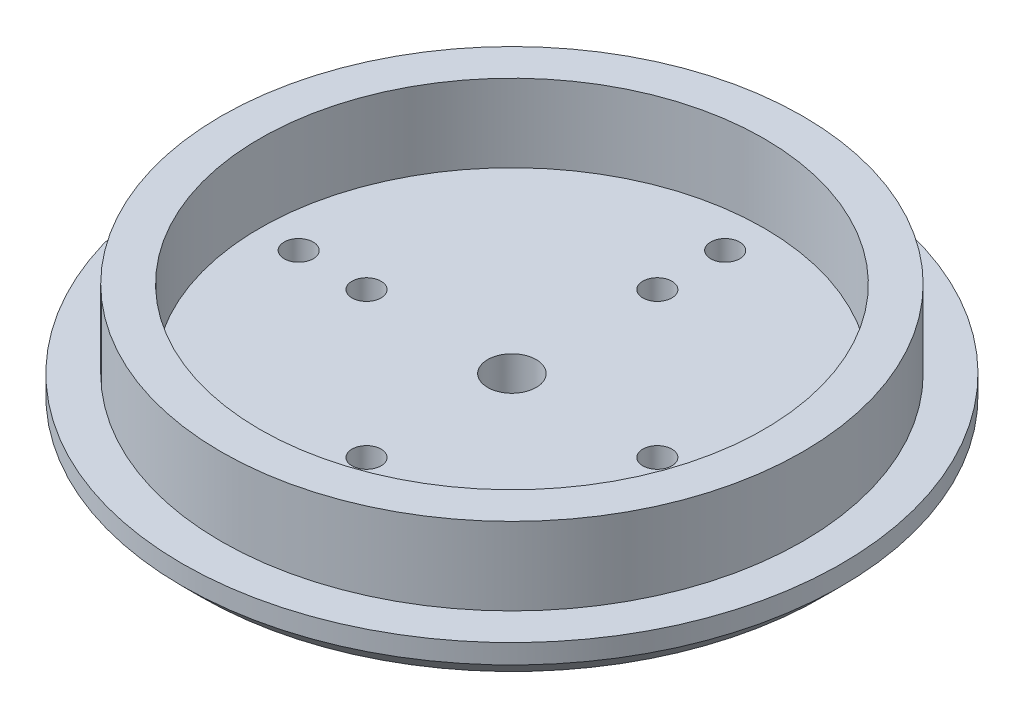
ISO-10303-21;
HEADER;
FILE_DESCRIPTION(('STEP AP214'),'2;1');
FILE_NAME('part.step','',(''),(''),'','','');
FILE_SCHEMA(('AUTOMOTIVE_DESIGN { 1 0 10303 214 1 1 1 1 }'));
ENDSEC;
DATA;
#1=APPLICATION_CONTEXT('core data for automotive mechanical design processes');
#2=APPLICATION_PROTOCOL_DEFINITION('international standard','automotive_design',2000,#1);
#3=PRODUCT_CONTEXT('',#1,'mechanical');
#4=PRODUCT('Part','Part','',(#3));
#5=PRODUCT_RELATED_PRODUCT_CATEGORY('part','',(#4));
#6=PRODUCT_DEFINITION_FORMATION('','',#4);
#7=PRODUCT_DEFINITION_CONTEXT('part definition',#1,'design');
#8=PRODUCT_DEFINITION('design','',#6,#7);
#9=PRODUCT_DEFINITION_SHAPE('','',#8);
#10=(LENGTH_UNIT() NAMED_UNIT(*) SI_UNIT(.MILLI.,.METRE.));
#11=(NAMED_UNIT(*) PLANE_ANGLE_UNIT() SI_UNIT($,.RADIAN.));
#12=(NAMED_UNIT(*) SI_UNIT($,.STERADIAN.) SOLID_ANGLE_UNIT());
#13=UNCERTAINTY_MEASURE_WITH_UNIT(LENGTH_MEASURE(1.E-05),#10,'distance_accuracy_value','');
#14=(GEOMETRIC_REPRESENTATION_CONTEXT(3) GLOBAL_UNCERTAINTY_ASSIGNED_CONTEXT((#13)) GLOBAL_UNIT_ASSIGNED_CONTEXT((#10,
#11,#12)) REPRESENTATION_CONTEXT('',''));
#15=CARTESIAN_POINT('',(0.,0.,0.));
#16=DIRECTION('',(0.,0.,1.));
#17=DIRECTION('',(1.,0.,0.));
#18=AXIS2_PLACEMENT_3D('',#15,#16,#17);
#19=CARTESIAN_POINT('',(0.,0.,0.));
#20=DIRECTION('',(0.,1.,0.));
#21=DIRECTION('',(0.,0.,1.));
#22=AXIS2_PLACEMENT_3D('',#19,#20,#21);
#23=PLANE('',#22);
#24=CARTESIAN_POINT('',(-13.7885822331375,0.,-19.4454364826302));
#25=DIRECTION('',(0.,-1.,0.));
#26=DIRECTION('',(0.,0.,-1.));
#27=AXIS2_PLACEMENT_3D('',#24,#25,#26);
#28=CIRCLE('',#27,0.999999999999996);
#29=CARTESIAN_POINT('',(-13.0814754519509,0.,-20.1525432638167));
#30=VERTEX_POINT('',#29);
#31=CARTESIAN_POINT('',(-14.495689014324,0.,-18.7383297014436));
#32=VERTEX_POINT('',#31);
#33=EDGE_CURVE('E154',#30,#32,#28,.T.);
#34=ORIENTED_EDGE('',*,*,#33,.F.);
#35=DIRECTION('',(0.707106781186541,0.,0.707106781186554));
#36=VECTOR('',#35,1.);
#37=CARTESIAN_POINT('',(-13.0814754519509,0.,-20.1525432638167));
#38=LINE('',#37,#36);
#39=CARTESIAN_POINT('',(-15.2027957955106,0.,-22.2738636073764));
#40=VERTEX_POINT('',#39);
#41=EDGE_CURVE('E170',#40,#30,#38,.T.);
#42=ORIENTED_EDGE('',*,*,#41,.F.);
#43=CARTESIAN_POINT('',(-15.9099025766971,0.,-21.5667568261898));
#44=DIRECTION('',(0.,-1.,0.));
#45=DIRECTION('',(0.,0.,-1.));
#46=AXIS2_PLACEMENT_3D('',#43,#44,#45);
#47=CIRCLE('',#46,0.999999999999995);
#48=CARTESIAN_POINT('',(-16.6170093578837,0.,-20.8596500450033));
#49=VERTEX_POINT('',#48);
#50=EDGE_CURVE('E183',#49,#40,#47,.T.);
#51=ORIENTED_EDGE('',*,*,#50,.F.);
#52=DIRECTION('',(-0.707106781186541,0.,-0.707106781186554));
#53=VECTOR('',#52,1.);
#54=CARTESIAN_POINT('',(-14.495689014324,0.,-18.7383297014436));
#55=LINE('',#54,#53);
#56=EDGE_CURVE('E159',#32,#49,#55,.T.);
#57=ORIENTED_EDGE('',*,*,#56,.F.);
#58=EDGE_LOOP('',(#34,#42,#51,#57));
#59=FACE_BOUND('',#58,.T.);
#60=CARTESIAN_POINT('',(0.,0.,0.));
#61=DIRECTION('',(0.,1.,0.));
#62=DIRECTION('',(0.,0.,1.));
#63=AXIS2_PLACEMENT_3D('',#60,#61,#62);
#64=CIRCLE('',#63,6.);
#65=CARTESIAN_POINT('',(0.,0.,6.));
#66=VERTEX_POINT('',#65);
#67=EDGE_CURVE('E312',#66,#66,#64,.F.);
#68=ORIENTED_EDGE('',*,*,#67,.F.);
#69=EDGE_LOOP('',(#68));
#70=FACE_BOUND('',#69,.T.);
#71=CARTESIAN_POINT('',(0.,0.,15.));
#72=DIRECTION('',(0.,-1.,0.));
#73=DIRECTION('',(0.,0.,-1.));
#74=AXIS2_PLACEMENT_3D('',#71,#72,#73);
#75=CIRCLE('',#74,1.5);
#76=CARTESIAN_POINT('',(0.,0.,13.5));
#77=VERTEX_POINT('',#76);
#78=EDGE_CURVE('E275',#77,#77,#75,.T.);
#79=ORIENTED_EDGE('',*,*,#78,.F.);
#80=EDGE_LOOP('',(#79));
#81=FACE_BOUND('',#80,.T.);
#82=CARTESIAN_POINT('',(0.,0.,22.));
#83=DIRECTION('',(0.,-1.,0.));
#84=DIRECTION('',(0.,0.,-1.));
#85=AXIS2_PLACEMENT_3D('',#82,#83,#84);
#86=CIRCLE('',#85,1.5);
#87=CARTESIAN_POINT('',(0.,0.,20.5));
#88=VERTEX_POINT('',#87);
#89=EDGE_CURVE('E280',#88,#88,#86,.T.);
#90=ORIENTED_EDGE('',*,*,#89,.F.);
#91=EDGE_LOOP('',(#90));
#92=FACE_BOUND('',#91,.T.);
#93=CARTESIAN_POINT('',(15.,0.,0.));
#94=DIRECTION('',(0.,-1.,0.));
#95=DIRECTION('',(0.,0.,-1.));
#96=AXIS2_PLACEMENT_3D('',#93,#94,#95);
#97=CIRCLE('',#96,1.5);
#98=CARTESIAN_POINT('',(15.,0.,-1.5));
#99=VERTEX_POINT('',#98);
#100=EDGE_CURVE('E284',#99,#99,#97,.T.);
#101=ORIENTED_EDGE('',*,*,#100,.F.);
#102=EDGE_LOOP('',(#101));
#103=FACE_BOUND('',#102,.T.);
#104=CARTESIAN_POINT('',(22.,0.,0.));
#105=DIRECTION('',(0.,-1.,0.));
#106=DIRECTION('',(0.,0.,-1.));
#107=AXIS2_PLACEMENT_3D('',#104,#105,#106);
#108=CIRCLE('',#107,1.5);
#109=CARTESIAN_POINT('',(22.,0.,-1.5));
#110=VERTEX_POINT('',#109);
#111=EDGE_CURVE('E263',#110,#110,#108,.T.);
#112=ORIENTED_EDGE('',*,*,#111,.F.);
#113=EDGE_LOOP('',(#112));
#114=FACE_BOUND('',#113,.T.);
#115=CARTESIAN_POINT('',(0.,0.,-15.));
#116=DIRECTION('',(0.,-1.,0.));
#117=DIRECTION('',(0.,0.,-1.));
#118=AXIS2_PLACEMENT_3D('',#115,#116,#117);
#119=CIRCLE('',#118,1.5);
#120=CARTESIAN_POINT('',(0.,0.,-16.5));
#121=VERTEX_POINT('',#120);
#122=EDGE_CURVE('E259',#121,#121,#119,.T.);
#123=ORIENTED_EDGE('',*,*,#122,.F.);
#124=EDGE_LOOP('',(#123));
#125=FACE_BOUND('',#124,.T.);
#126=CARTESIAN_POINT('',(0.,0.,-22.));
#127=DIRECTION('',(0.,-1.,0.));
#128=DIRECTION('',(0.,0.,-1.));
#129=AXIS2_PLACEMENT_3D('',#126,#127,#128);
#130=CIRCLE('',#129,1.5);
#131=CARTESIAN_POINT('',(0.,0.,-23.5));
#132=VERTEX_POINT('',#131);
#133=EDGE_CURVE('E264',#132,#132,#130,.T.);
#134=ORIENTED_EDGE('',*,*,#133,.F.);
#135=EDGE_LOOP('',(#134));
#136=FACE_BOUND('',#135,.T.);
#137=CARTESIAN_POINT('',(-15.,0.,0.));
#138=DIRECTION('',(0.,-1.,0.));
#139=DIRECTION('',(0.,0.,-1.));
#140=AXIS2_PLACEMENT_3D('',#137,#138,#139);
#141=CIRCLE('',#140,1.5);
#142=CARTESIAN_POINT('',(-15.,0.,-1.5));
#143=VERTEX_POINT('',#142);
#144=EDGE_CURVE('E268',#143,#143,#141,.T.);
#145=ORIENTED_EDGE('',*,*,#144,.F.);
#146=EDGE_LOOP('',(#145));
#147=FACE_BOUND('',#146,.T.);
#148=CARTESIAN_POINT('',(-22.,0.,0.));
#149=DIRECTION('',(0.,-1.,0.));
#150=DIRECTION('',(0.,0.,-1.));
#151=AXIS2_PLACEMENT_3D('',#148,#149,#150);
#152=CIRCLE('',#151,1.5);
#153=CARTESIAN_POINT('',(-22.,0.,-1.50000000000001));
#154=VERTEX_POINT('',#153);
#155=EDGE_CURVE('E258',#154,#154,#152,.T.);
#156=ORIENTED_EDGE('',*,*,#155,.F.);
#157=EDGE_LOOP('',(#156));
#158=FACE_BOUND('',#157,.T.);
#159=CARTESIAN_POINT('',(0.,0.,0.));
#160=DIRECTION('',(0.,1.,0.));
#161=DIRECTION('',(0.,0.,1.));
#162=AXIS2_PLACEMENT_3D('',#159,#160,#161);
#163=CIRCLE('',#162,32.);
#164=CARTESIAN_POINT('',(0.,0.,32.));
#165=VERTEX_POINT('',#164);
#166=EDGE_CURVE('E11',#165,#165,#163,.F.);
#167=ORIENTED_EDGE('',*,*,#166,.T.);
#168=EDGE_LOOP('',(#167));
#169=FACE_BOUND('',#168,.T.);
#170=CARTESIAN_POINT('',(-18.7383297014433,0.,-18.7383297014437));
#171=DIRECTION('',(0.,-1.,0.));
#172=DIRECTION('',(0.,0.,-1.));
#173=AXIS2_PLACEMENT_3D('',#170,#171,#172);
#174=CIRCLE('',#173,1.);
#175=CARTESIAN_POINT('',(-19.4454364826299,0.,-18.0312229202571));
#176=VERTEX_POINT('',#175);
#177=CARTESIAN_POINT('',(-18.0312229202568,0.,-19.4454364826302));
#178=VERTEX_POINT('',#177);
#179=EDGE_CURVE('E205',#176,#178,#174,.T.);
#180=ORIENTED_EDGE('',*,*,#179,.F.);
#181=DIRECTION('',(-0.707106781186541,0.,-0.707106781186555));
#182=VECTOR('',#181,1.);
#183=CARTESIAN_POINT('',(-19.4454364826299,0.,-18.0312229202571));
#184=LINE('',#183,#182);
#185=CARTESIAN_POINT('',(-17.3241161390703,0.,-15.9099025766975));
#186=VERTEX_POINT('',#185);
#187=EDGE_CURVE('E211',#186,#176,#184,.T.);
#188=ORIENTED_EDGE('',*,*,#187,.F.);
#189=CARTESIAN_POINT('',(-16.6170093578837,0.,-16.617009357884));
#190=DIRECTION('',(0.,-1.,0.));
#191=DIRECTION('',(0.,0.,-1.));
#192=AXIS2_PLACEMENT_3D('',#189,#190,#191);
#193=CIRCLE('',#192,1.);
#194=CARTESIAN_POINT('',(-15.9099025766972,0.,-17.3241161390706));
#195=VERTEX_POINT('',#194);
#196=EDGE_CURVE('E228',#195,#186,#193,.T.);
#197=ORIENTED_EDGE('',*,*,#196,.F.);
#198=DIRECTION('',(0.707106781186541,0.,0.707106781186554));
#199=VECTOR('',#198,1.);
#200=CARTESIAN_POINT('',(-18.0312229202568,0.,-19.4454364826302));
#201=LINE('',#200,#199);
#202=EDGE_CURVE('E224',#178,#195,#201,.T.);
#203=ORIENTED_EDGE('',*,*,#202,.F.);
#204=EDGE_LOOP('',(#180,#188,#197,#203));
#205=FACE_BOUND('',#204,.T.);
#206=CARTESIAN_POINT('',(-19.4454364826299,0.,-13.7885822331379));
#207=DIRECTION('',(0.,-1.,0.));
#208=DIRECTION('',(0.,0.,1.));
#209=AXIS2_PLACEMENT_3D('',#206,#207,#208);
#210=CIRCLE('',#209,0.999999999999995);
#211=CARTESIAN_POINT('',(-18.7383297014434,0.,-14.4956890143244));
#212=VERTEX_POINT('',#211);
#213=CARTESIAN_POINT('',(-20.1525432638165,0.,-13.0814754519513));
#214=VERTEX_POINT('',#213);
#215=EDGE_CURVE('E152',#212,#214,#210,.T.);
#216=ORIENTED_EDGE('',*,*,#215,.F.);
#217=DIRECTION('',(0.707106781186541,0.,0.707106781186554));
#218=VECTOR('',#217,1.);
#219=CARTESIAN_POINT('',(-18.7383297014434,0.,-14.4956890143244));
#220=LINE('',#219,#218);
#221=CARTESIAN_POINT('',(-20.859650045003,0.,-16.617009357884));
#222=VERTEX_POINT('',#221);
#223=EDGE_CURVE('E149',#222,#212,#220,.T.);
#224=ORIENTED_EDGE('',*,*,#223,.F.);
#225=CARTESIAN_POINT('',(-21.5667568261896,0.,-15.9099025766975));
#226=DIRECTION('',(0.,-1.,0.));
#227=DIRECTION('',(0.,0.,1.));
#228=AXIS2_PLACEMENT_3D('',#225,#226,#227);
#229=CIRCLE('',#228,0.999999999999997);
#230=CARTESIAN_POINT('',(-22.2738636073761,0.,-15.202795795511));
#231=VERTEX_POINT('',#230);
#232=EDGE_CURVE('E61',#231,#222,#229,.T.);
#233=ORIENTED_EDGE('',*,*,#232,.F.);
#234=DIRECTION('',(-0.707106781186542,0.,-0.707106781186553));
#235=VECTOR('',#234,1.);
#236=CARTESIAN_POINT('',(-20.1525432638165,0.,-13.0814754519513));
#237=LINE('',#236,#235);
#238=EDGE_CURVE('E56',#214,#231,#237,.T.);
#239=ORIENTED_EDGE('',*,*,#238,.F.);
#240=EDGE_LOOP('',(#216,#224,#233,#239));
#241=FACE_BOUND('',#240,.T.);
#242=ADVANCED_FACE('F40',(#59,#70,#81,#92,#103,#114,#125,#136,#147,#158,#169,#205,#241),#23,.F.);
#243=CARTESIAN_POINT('',(0.,4.,0.));
#244=DIRECTION('',(0.,-1.,0.));
#245=DIRECTION('',(0.,0.,-1.));
#246=AXIS2_PLACEMENT_3D('',#243,#244,#245);
#247=CYLINDRICAL_SURFACE('',#246,34.);
#248=CARTESIAN_POINT('',(0.,2.00000000000002,0.));
#249=DIRECTION('',(0.,1.,0.));
#250=DIRECTION('',(0.,0.,1.));
#251=AXIS2_PLACEMENT_3D('',#248,#249,#250);
#252=CIRCLE('',#251,34.);
#253=CARTESIAN_POINT('',(0.,2.00000000000002,34.));
#254=VERTEX_POINT('',#253);
#255=EDGE_CURVE('E49',#254,#254,#252,.T.);
#256=ORIENTED_EDGE('',*,*,#255,.T.);
#257=EDGE_LOOP('',(#256));
#258=FACE_BOUND('',#257,.T.);
#259=CARTESIAN_POINT('',(0.,4.,0.));
#260=DIRECTION('',(0.,1.,0.));
#261=DIRECTION('',(0.,0.,1.));
#262=AXIS2_PLACEMENT_3D('',#259,#260,#261);
#263=CIRCLE('',#262,34.);
#264=CARTESIAN_POINT('',(0.,4.,34.));
#265=VERTEX_POINT('',#264);
#266=EDGE_CURVE('E301',#265,#265,#263,.T.);
#267=ORIENTED_EDGE('',*,*,#266,.F.);
#268=EDGE_LOOP('',(#267));
#269=FACE_BOUND('',#268,.T.);
#270=ADVANCED_FACE('F353',(#258,#269),#247,.T.);
#271=CARTESIAN_POINT('',(0.,4.,0.));
#272=DIRECTION('',(0.,1.,0.));
#273=DIRECTION('',(0.,0.,1.));
#274=AXIS2_PLACEMENT_3D('',#271,#272,#273);
#275=PLANE('',#274);
#276=CARTESIAN_POINT('',(0.,4.,0.));
#277=DIRECTION('',(0.,1.,0.));
#278=DIRECTION('',(0.,0.,1.));
#279=AXIS2_PLACEMENT_3D('',#276,#277,#278);
#280=CIRCLE('',#279,30.);
#281=CARTESIAN_POINT('',(0.,4.,30.));
#282=VERTEX_POINT('',#281);
#283=EDGE_CURVE('E295',#282,#282,#280,.T.);
#284=ORIENTED_EDGE('',*,*,#283,.F.);
#285=EDGE_LOOP('',(#284));
#286=FACE_BOUND('',#285,.T.);
#287=ORIENTED_EDGE('',*,*,#266,.T.);
#288=EDGE_LOOP('',(#287));
#289=FACE_BOUND('',#288,.T.);
#290=ADVANCED_FACE('F377',(#286,#289),#275,.T.);
#291=CARTESIAN_POINT('',(0.,12.,0.));
#292=DIRECTION('',(0.,1.,0.));
#293=DIRECTION('',(0.,0.,1.));
#294=AXIS2_PLACEMENT_3D('',#291,#292,#293);
#295=PLANE('',#294);
#296=CARTESIAN_POINT('',(0.,12.,0.));
#297=DIRECTION('',(0.,1.,0.));
#298=DIRECTION('',(0.,0.,1.));
#299=AXIS2_PLACEMENT_3D('',#296,#297,#298);
#300=CIRCLE('',#299,30.);
#301=CARTESIAN_POINT('',(0.,12.,30.));
#302=VERTEX_POINT('',#301);
#303=EDGE_CURVE('E297',#302,#302,#300,.T.);
#304=ORIENTED_EDGE('',*,*,#303,.T.);
#305=EDGE_LOOP('',(#304));
#306=FACE_BOUND('',#305,.T.);
#307=CARTESIAN_POINT('',(0.,12.,0.));
#308=DIRECTION('',(0.,1.,0.));
#309=DIRECTION('',(0.,0.,1.));
#310=AXIS2_PLACEMENT_3D('',#307,#308,#309);
#311=CIRCLE('',#310,26.);
#312=CARTESIAN_POINT('',(0.,12.,26.));
#313=VERTEX_POINT('',#312);
#314=EDGE_CURVE('E291',#313,#313,#311,.T.);
#315=ORIENTED_EDGE('',*,*,#314,.F.);
#316=EDGE_LOOP('',(#315));
#317=FACE_BOUND('',#316,.T.);
#318=ADVANCED_FACE('F382',(#306,#317),#295,.T.);
#319=CARTESIAN_POINT('',(0.,12.,0.));
#320=DIRECTION('',(0.,-1.,0.));
#321=DIRECTION('',(0.,0.,-1.));
#322=AXIS2_PLACEMENT_3D('',#319,#320,#321);
#323=CYLINDRICAL_SURFACE('',#322,30.);
#324=ORIENTED_EDGE('',*,*,#303,.F.);
#325=EDGE_LOOP('',(#324));
#326=FACE_BOUND('',#325,.T.);
#327=ORIENTED_EDGE('',*,*,#283,.T.);
#328=EDGE_LOOP('',(#327));
#329=FACE_BOUND('',#328,.T.);
#330=ADVANCED_FACE('F385',(#326,#329),#323,.T.);
#331=CARTESIAN_POINT('',(0.,12.,0.));
#332=DIRECTION('',(0.,-1.,0.));
#333=DIRECTION('',(0.,0.,-1.));
#334=AXIS2_PLACEMENT_3D('',#331,#332,#333);
#335=CYLINDRICAL_SURFACE('',#334,26.);
#336=ORIENTED_EDGE('',*,*,#314,.T.);
#337=EDGE_LOOP('',(#336));
#338=FACE_BOUND('',#337,.T.);
#339=CARTESIAN_POINT('',(0.,4.,0.));
#340=DIRECTION('',(0.,1.,0.));
#341=DIRECTION('',(0.,0.,1.));
#342=AXIS2_PLACEMENT_3D('',#339,#340,#341);
#343=CIRCLE('',#342,26.);
#344=CARTESIAN_POINT('',(0.,4.,26.));
#345=VERTEX_POINT('',#344);
#346=EDGE_CURVE('E308',#345,#345,#343,.F.);
#347=ORIENTED_EDGE('',*,*,#346,.T.);
#348=EDGE_LOOP('',(#347));
#349=FACE_BOUND('',#348,.T.);
#350=ADVANCED_FACE('F388',(#338,#349),#335,.F.);
#351=CARTESIAN_POINT('',(0.,4.,15.));
#352=DIRECTION('',(0.,1.,0.));
#353=DIRECTION('',(0.,0.,1.));
#354=AXIS2_PLACEMENT_3D('',#351,#352,#353);
#355=CIRCLE('',#354,1.5);
#356=CARTESIAN_POINT('',(0.,4.,16.5));
#357=VERTEX_POINT('',#356);
#358=EDGE_CURVE('E296',#357,#357,#355,.T.);
#359=ORIENTED_EDGE('',*,*,#358,.F.);
#360=EDGE_LOOP('',(#359));
#361=FACE_BOUND('',#360,.T.);
#362=CARTESIAN_POINT('',(0.,4.,22.));
#363=DIRECTION('',(0.,1.,0.));
#364=DIRECTION('',(0.,0.,1.));
#365=AXIS2_PLACEMENT_3D('',#362,#363,#364);
#366=CIRCLE('',#365,1.5);
#367=CARTESIAN_POINT('',(0.,4.,23.5));
#368=VERTEX_POINT('',#367);
#369=EDGE_CURVE('E340',#368,#368,#366,.T.);
#370=ORIENTED_EDGE('',*,*,#369,.F.);
#371=EDGE_LOOP('',(#370));
#372=FACE_BOUND('',#371,.T.);
#373=CARTESIAN_POINT('',(15.,4.,0.));
#374=DIRECTION('',(0.,1.,0.));
#375=DIRECTION('',(0.,0.,1.));
#376=AXIS2_PLACEMENT_3D('',#373,#374,#375);
#377=CIRCLE('',#376,1.5);
#378=CARTESIAN_POINT('',(15.,4.,1.5));
#379=VERTEX_POINT('',#378);
#380=EDGE_CURVE('E336',#379,#379,#377,.T.);
#381=ORIENTED_EDGE('',*,*,#380,.F.);
#382=EDGE_LOOP('',(#381));
#383=FACE_BOUND('',#382,.T.);
#384=CARTESIAN_POINT('',(22.,4.,0.));
#385=DIRECTION('',(0.,1.,0.));
#386=DIRECTION('',(0.,0.,1.));
#387=AXIS2_PLACEMENT_3D('',#384,#385,#386);
#388=CIRCLE('',#387,1.5);
#389=CARTESIAN_POINT('',(22.,4.,1.5));
#390=VERTEX_POINT('',#389);
#391=EDGE_CURVE('E332',#390,#390,#388,.T.);
#392=ORIENTED_EDGE('',*,*,#391,.F.);
#393=EDGE_LOOP('',(#392));
#394=FACE_BOUND('',#393,.T.);
#395=CARTESIAN_POINT('',(0.,4.,-15.));
#396=DIRECTION('',(0.,1.,0.));
#397=DIRECTION('',(0.,0.,1.));
#398=AXIS2_PLACEMENT_3D('',#395,#396,#397);
#399=CIRCLE('',#398,1.5);
#400=CARTESIAN_POINT('',(0.,4.,-13.5));
#401=VERTEX_POINT('',#400);
#402=EDGE_CURVE('E328',#401,#401,#399,.T.);
#403=ORIENTED_EDGE('',*,*,#402,.F.);
#404=EDGE_LOOP('',(#403));
#405=FACE_BOUND('',#404,.T.);
#406=CARTESIAN_POINT('',(0.,4.,-22.));
#407=DIRECTION('',(0.,1.,0.));
#408=DIRECTION('',(0.,0.,1.));
#409=AXIS2_PLACEMENT_3D('',#406,#407,#408);
#410=CIRCLE('',#409,1.5);
#411=CARTESIAN_POINT('',(0.,4.,-20.5));
#412=VERTEX_POINT('',#411);
#413=EDGE_CURVE('E324',#412,#412,#410,.T.);
#414=ORIENTED_EDGE('',*,*,#413,.F.);
#415=EDGE_LOOP('',(#414));
#416=FACE_BOUND('',#415,.T.);
#417=CARTESIAN_POINT('',(-15.,4.,0.));
#418=DIRECTION('',(0.,1.,0.));
#419=DIRECTION('',(0.,0.,1.));
#420=AXIS2_PLACEMENT_3D('',#417,#418,#419);
#421=CIRCLE('',#420,1.5);
#422=CARTESIAN_POINT('',(-15.,4.,1.5));
#423=VERTEX_POINT('',#422);
#424=EDGE_CURVE('E320',#423,#423,#421,.T.);
#425=ORIENTED_EDGE('',*,*,#424,.F.);
#426=EDGE_LOOP('',(#425));
#427=FACE_BOUND('',#426,.T.);
#428=CARTESIAN_POINT('',(-22.,4.,0.));
#429=DIRECTION('',(0.,1.,0.));
#430=DIRECTION('',(0.,0.,1.));
#431=AXIS2_PLACEMENT_3D('',#428,#429,#430);
#432=CIRCLE('',#431,1.5);
#433=CARTESIAN_POINT('',(-22.,4.,1.5));
#434=VERTEX_POINT('',#433);
#435=EDGE_CURVE('E316',#434,#434,#432,.T.);
#436=ORIENTED_EDGE('',*,*,#435,.F.);
#437=EDGE_LOOP('',(#436));
#438=FACE_BOUND('',#437,.T.);
#439=CARTESIAN_POINT('',(0.,4.,0.));
#440=DIRECTION('',(0.,1.,0.));
#441=DIRECTION('',(0.,0.,1.));
#442=AXIS2_PLACEMENT_3D('',#439,#440,#441);
#443=CIRCLE('',#442,2.5);
#444=CARTESIAN_POINT('',(0.,4.,2.5));
#445=VERTEX_POINT('',#444);
#446=EDGE_CURVE('E279',#445,#445,#443,.T.);
#447=ORIENTED_EDGE('',*,*,#446,.F.);
#448=EDGE_LOOP('',(#447));
#449=FACE_BOUND('',#448,.T.);
#450=ORIENTED_EDGE('',*,*,#346,.F.);
#451=EDGE_LOOP('',(#450));
#452=FACE_BOUND('',#451,.T.);
#453=ADVANCED_FACE('F384',(#361,#372,#383,#394,#405,#416,#427,#438,#449,#452),#275,.T.);
#454=CARTESIAN_POINT('',(0.,12.,0.));
#455=DIRECTION('',(0.,-1.,0.));
#456=DIRECTION('',(0.,0.,-1.));
#457=AXIS2_PLACEMENT_3D('',#454,#455,#456);
#458=CYLINDRICAL_SURFACE('',#457,2.5);
#459=ORIENTED_EDGE('',*,*,#446,.T.);
#460=EDGE_LOOP('',(#459));
#461=FACE_BOUND('',#460,.T.);
#462=CARTESIAN_POINT('',(0.,-1.,0.));
#463=DIRECTION('',(0.,-1.,0.));
#464=DIRECTION('',(0.,0.,-1.));
#465=AXIS2_PLACEMENT_3D('',#462,#463,#464);
#466=CIRCLE('',#465,2.5);
#467=CARTESIAN_POINT('',(0.,-1.,-2.5));
#468=VERTEX_POINT('',#467);
#469=EDGE_CURVE('E250',#468,#468,#466,.T.);
#470=ORIENTED_EDGE('',*,*,#469,.T.);
#471=EDGE_LOOP('',(#470));
#472=FACE_BOUND('',#471,.T.);
#473=ADVANCED_FACE('F396',(#461,#472),#458,.F.);
#474=CARTESIAN_POINT('',(-22.,12.,0.));
#475=DIRECTION('',(0.,-1.,0.));
#476=DIRECTION('',(0.,0.,-1.));
#477=AXIS2_PLACEMENT_3D('',#474,#475,#476);
#478=CYLINDRICAL_SURFACE('',#477,1.5);
#479=ORIENTED_EDGE('',*,*,#435,.T.);
#480=EDGE_LOOP('',(#479));
#481=FACE_BOUND('',#480,.T.);
#482=ORIENTED_EDGE('',*,*,#155,.T.);
#483=EDGE_LOOP('',(#482));
#484=FACE_BOUND('',#483,.T.);
#485=ADVANCED_FACE('F399',(#481,#484),#478,.F.);
#486=CARTESIAN_POINT('',(-15.,12.,0.));
#487=DIRECTION('',(0.,-1.,0.));
#488=DIRECTION('',(0.,0.,-1.));
#489=AXIS2_PLACEMENT_3D('',#486,#487,#488);
#490=CYLINDRICAL_SURFACE('',#489,1.5);
#491=ORIENTED_EDGE('',*,*,#424,.T.);
#492=EDGE_LOOP('',(#491));
#493=FACE_BOUND('',#492,.T.);
#494=ORIENTED_EDGE('',*,*,#144,.T.);
#495=EDGE_LOOP('',(#494));
#496=FACE_BOUND('',#495,.T.);
#497=ADVANCED_FACE('F420',(#493,#496),#490,.F.);
#498=CARTESIAN_POINT('',(0.,12.,-22.));
#499=DIRECTION('',(0.,-1.,0.));
#500=DIRECTION('',(0.,0.,-1.));
#501=AXIS2_PLACEMENT_3D('',#498,#499,#500);
#502=CYLINDRICAL_SURFACE('',#501,1.5);
#503=ORIENTED_EDGE('',*,*,#413,.T.);
#504=EDGE_LOOP('',(#503));
#505=FACE_BOUND('',#504,.T.);
#506=ORIENTED_EDGE('',*,*,#133,.T.);
#507=EDGE_LOOP('',(#506));
#508=FACE_BOUND('',#507,.T.);
#509=ADVANCED_FACE('F424',(#505,#508),#502,.F.);
#510=CARTESIAN_POINT('',(0.,12.,-15.));
#511=DIRECTION('',(0.,-1.,0.));
#512=DIRECTION('',(0.,0.,-1.));
#513=AXIS2_PLACEMENT_3D('',#510,#511,#512);
#514=CYLINDRICAL_SURFACE('',#513,1.5);
#515=ORIENTED_EDGE('',*,*,#402,.T.);
#516=EDGE_LOOP('',(#515));
#517=FACE_BOUND('',#516,.T.);
#518=ORIENTED_EDGE('',*,*,#122,.T.);
#519=EDGE_LOOP('',(#518));
#520=FACE_BOUND('',#519,.T.);
#521=ADVANCED_FACE('F405',(#517,#520),#514,.F.);
#522=CARTESIAN_POINT('',(22.,12.,0.));
#523=DIRECTION('',(0.,-1.,0.));
#524=DIRECTION('',(0.,0.,-1.));
#525=AXIS2_PLACEMENT_3D('',#522,#523,#524);
#526=CYLINDRICAL_SURFACE('',#525,1.5);
#527=ORIENTED_EDGE('',*,*,#391,.T.);
#528=EDGE_LOOP('',(#527));
#529=FACE_BOUND('',#528,.T.);
#530=ORIENTED_EDGE('',*,*,#111,.T.);
#531=EDGE_LOOP('',(#530));
#532=FACE_BOUND('',#531,.T.);
#533=ADVANCED_FACE('F401',(#529,#532),#526,.F.);
#534=CARTESIAN_POINT('',(15.,12.,0.));
#535=DIRECTION('',(0.,-1.,0.));
#536=DIRECTION('',(0.,0.,-1.));
#537=AXIS2_PLACEMENT_3D('',#534,#535,#536);
#538=CYLINDRICAL_SURFACE('',#537,1.5);
#539=ORIENTED_EDGE('',*,*,#380,.T.);
#540=EDGE_LOOP('',(#539));
#541=FACE_BOUND('',#540,.T.);
#542=ORIENTED_EDGE('',*,*,#100,.T.);
#543=EDGE_LOOP('',(#542));
#544=FACE_BOUND('',#543,.T.);
#545=ADVANCED_FACE('F404',(#541,#544),#538,.F.);
#546=CARTESIAN_POINT('',(0.,12.,22.));
#547=DIRECTION('',(0.,-1.,0.));
#548=DIRECTION('',(0.,0.,-1.));
#549=AXIS2_PLACEMENT_3D('',#546,#547,#548);
#550=CYLINDRICAL_SURFACE('',#549,1.5);
#551=ORIENTED_EDGE('',*,*,#369,.T.);
#552=EDGE_LOOP('',(#551));
#553=FACE_BOUND('',#552,.T.);
#554=ORIENTED_EDGE('',*,*,#89,.T.);
#555=EDGE_LOOP('',(#554));
#556=FACE_BOUND('',#555,.T.);
#557=ADVANCED_FACE('F409',(#553,#556),#550,.F.);
#558=CARTESIAN_POINT('',(0.,12.,15.));
#559=DIRECTION('',(0.,-1.,0.));
#560=DIRECTION('',(0.,0.,-1.));
#561=AXIS2_PLACEMENT_3D('',#558,#559,#560);
#562=CYLINDRICAL_SURFACE('',#561,1.5);
#563=ORIENTED_EDGE('',*,*,#358,.T.);
#564=EDGE_LOOP('',(#563));
#565=FACE_BOUND('',#564,.T.);
#566=ORIENTED_EDGE('',*,*,#78,.T.);
#567=EDGE_LOOP('',(#566));
#568=FACE_BOUND('',#567,.T.);
#569=ADVANCED_FACE('F413',(#565,#568),#562,.F.);
#570=CARTESIAN_POINT('',(0.,-1.,0.));
#571=DIRECTION('',(0.,-1.,0.));
#572=DIRECTION('',(0.,0.,-1.));
#573=AXIS2_PLACEMENT_3D('',#570,#571,#572);
#574=PLANE('',#573);
#575=CARTESIAN_POINT('',(0.,-1.,0.));
#576=DIRECTION('',(0.,-1.,0.));
#577=DIRECTION('',(0.,0.,-1.));
#578=AXIS2_PLACEMENT_3D('',#575,#576,#577);
#579=CIRCLE('',#578,6.);
#580=CARTESIAN_POINT('',(0.,-1.,-6.));
#581=VERTEX_POINT('',#580);
#582=EDGE_CURVE('E254',#581,#581,#579,.T.);
#583=ORIENTED_EDGE('',*,*,#582,.T.);
#584=EDGE_LOOP('',(#583));
#585=FACE_BOUND('',#584,.T.);
#586=ORIENTED_EDGE('',*,*,#469,.F.);
#587=EDGE_LOOP('',(#586));
#588=FACE_BOUND('',#587,.T.);
#589=ADVANCED_FACE('F367',(#585,#588),#574,.T.);
#590=CARTESIAN_POINT('',(0.,-1.,0.));
#591=DIRECTION('',(0.,1.,0.));
#592=DIRECTION('',(0.,0.,1.));
#593=AXIS2_PLACEMENT_3D('',#590,#591,#592);
#594=CYLINDRICAL_SURFACE('',#593,6.);
#595=ORIENTED_EDGE('',*,*,#582,.F.);
#596=EDGE_LOOP('',(#595));
#597=FACE_BOUND('',#596,.T.);
#598=ORIENTED_EDGE('',*,*,#67,.T.);
#599=EDGE_LOOP('',(#598));
#600=FACE_BOUND('',#599,.T.);
#601=ADVANCED_FACE('F358',(#597,#600),#594,.T.);
#602=CARTESIAN_POINT('',(0.,2.00000000000002,0.));
#603=DIRECTION('',(0.,1.,0.));
#604=DIRECTION('',(0.,0.,1.));
#605=AXIS2_PLACEMENT_3D('',#602,#603,#604);
#606=CONICAL_SURFACE('',#605,34.,0.78539816339745);
#607=ORIENTED_EDGE('',*,*,#166,.F.);
#608=EDGE_LOOP('',(#607));
#609=FACE_BOUND('',#608,.T.);
#610=ORIENTED_EDGE('',*,*,#255,.F.);
#611=EDGE_LOOP('',(#610));
#612=FACE_BOUND('',#611,.T.);
#613=ADVANCED_FACE('F42',(#609,#612),#606,.T.);
#614=CARTESIAN_POINT('',(-18.7383297014433,-1.,-18.7383297014437));
#615=DIRECTION('',(0.,1.,0.));
#616=DIRECTION('',(0.,0.,1.));
#617=AXIS2_PLACEMENT_3D('',#614,#615,#616);
#618=CYLINDRICAL_SURFACE('',#617,1.);
#619=ORIENTED_EDGE('',*,*,#179,.T.);
#620=DIRECTION('',(0.,1.,0.));
#621=VECTOR('',#620,1.);
#622=CARTESIAN_POINT('',(-18.0312229202568,-1.,-19.4454364826302));
#623=LINE('',#622,#621);
#624=CARTESIAN_POINT('',(-18.0312229202568,-1.,-19.4454364826302));
#625=VERTEX_POINT('',#624);
#626=EDGE_CURVE('E246',#625,#178,#623,.T.);
#627=ORIENTED_EDGE('',*,*,#626,.F.);
#628=CARTESIAN_POINT('',(-18.7383297014433,-1.,-18.7383297014437));
#629=DIRECTION('',(0.,-1.,0.));
#630=DIRECTION('',(0.,0.,-1.));
#631=AXIS2_PLACEMENT_3D('',#628,#629,#630);
#632=CIRCLE('',#631,1.);
#633=CARTESIAN_POINT('',(-19.4454364826299,-1.,-18.0312229202571));
#634=VERTEX_POINT('',#633);
#635=EDGE_CURVE('E206',#634,#625,#632,.T.);
#636=ORIENTED_EDGE('',*,*,#635,.F.);
#637=DIRECTION('',(0.,1.,0.));
#638=VECTOR('',#637,1.);
#639=CARTESIAN_POINT('',(-19.4454364826299,-1.,-18.0312229202571));
#640=LINE('',#639,#638);
#641=EDGE_CURVE('E220',#634,#176,#640,.T.);
#642=ORIENTED_EDGE('',*,*,#641,.T.);
#643=EDGE_LOOP('',(#619,#627,#636,#642));
#644=FACE_BOUND('',#643,.T.);
#645=ADVANCED_FACE('F357',(#644),#618,.T.);
#646=CARTESIAN_POINT('',(-18.0312229202568,-1.,-19.4454364826302));
#647=DIRECTION('',(-0.707106781186554,0.,0.707106781186541));
#648=DIRECTION('',(0.707106781186541,0.,0.707106781186554));
#649=AXIS2_PLACEMENT_3D('',#646,#647,#648);
#650=PLANE('',#649);
#651=ORIENTED_EDGE('',*,*,#202,.T.);
#652=DIRECTION('',(0.,1.,0.));
#653=VECTOR('',#652,1.);
#654=CARTESIAN_POINT('',(-15.9099025766972,-1.,-17.3241161390706));
#655=LINE('',#654,#653);
#656=CARTESIAN_POINT('',(-15.9099025766972,-1.,-17.3241161390706));
#657=VERTEX_POINT('',#656);
#658=EDGE_CURVE('E242',#657,#195,#655,.T.);
#659=ORIENTED_EDGE('',*,*,#658,.F.);
#660=DIRECTION('',(0.707106781186541,0.,0.707106781186554));
#661=VECTOR('',#660,1.);
#662=CARTESIAN_POINT('',(-18.0312229202568,-1.,-19.4454364826302));
#663=LINE('',#662,#661);
#664=EDGE_CURVE('E210',#625,#657,#663,.T.);
#665=ORIENTED_EDGE('',*,*,#664,.F.);
#666=ORIENTED_EDGE('',*,*,#626,.T.);
#667=EDGE_LOOP('',(#651,#659,#665,#666));
#668=FACE_BOUND('',#667,.T.);
#669=ADVANCED_FACE('F364',(#668),#650,.F.);
#670=CARTESIAN_POINT('',(-16.6170093578837,-1.,-16.617009357884));
#671=DIRECTION('',(0.,1.,0.));
#672=DIRECTION('',(0.,0.,1.));
#673=AXIS2_PLACEMENT_3D('',#670,#671,#672);
#674=CYLINDRICAL_SURFACE('',#673,1.);
#675=ORIENTED_EDGE('',*,*,#196,.T.);
#676=DIRECTION('',(0.,1.,0.));
#677=VECTOR('',#676,1.);
#678=CARTESIAN_POINT('',(-17.3241161390703,-1.,-15.9099025766975));
#679=LINE('',#678,#677);
#680=CARTESIAN_POINT('',(-17.3241161390703,-1.,-15.9099025766975));
#681=VERTEX_POINT('',#680);
#682=EDGE_CURVE('E238',#681,#186,#679,.T.);
#683=ORIENTED_EDGE('',*,*,#682,.F.);
#684=CARTESIAN_POINT('',(-16.6170093578837,-1.,-16.617009357884));
#685=DIRECTION('',(0.,-1.,0.));
#686=DIRECTION('',(0.,0.,-1.));
#687=AXIS2_PLACEMENT_3D('',#684,#685,#686);
#688=CIRCLE('',#687,1.);
#689=EDGE_CURVE('E214',#657,#681,#688,.T.);
#690=ORIENTED_EDGE('',*,*,#689,.F.);
#691=ORIENTED_EDGE('',*,*,#658,.T.);
#692=EDGE_LOOP('',(#675,#683,#690,#691));
#693=FACE_BOUND('',#692,.T.);
#694=ADVANCED_FACE('F437',(#693),#674,.T.);
#695=CARTESIAN_POINT('',(-19.4454364826299,-1.,-18.0312229202571));
#696=DIRECTION('',(0.707106781186555,0.,-0.707106781186541));
#697=DIRECTION('',(-0.707106781186541,0.,-0.707106781186554));
#698=AXIS2_PLACEMENT_3D('',#695,#696,#697);
#699=PLANE('',#698);
#700=ORIENTED_EDGE('',*,*,#187,.T.);
#701=ORIENTED_EDGE('',*,*,#641,.F.);
#702=DIRECTION('',(-0.707106781186541,0.,-0.707106781186555));
#703=VECTOR('',#702,1.);
#704=CARTESIAN_POINT('',(-19.4454364826299,-1.,-18.0312229202571));
#705=LINE('',#704,#703);
#706=EDGE_CURVE('E217',#681,#634,#705,.T.);
#707=ORIENTED_EDGE('',*,*,#706,.F.);
#708=ORIENTED_EDGE('',*,*,#682,.T.);
#709=EDGE_LOOP('',(#700,#701,#707,#708));
#710=FACE_BOUND('',#709,.T.);
#711=ADVANCED_FACE('F441',(#710),#699,.F.);
#712=CARTESIAN_POINT('',(-18.7383297014433,-1.,-18.7383297014437));
#713=DIRECTION('',(0.,-1.,0.));
#714=DIRECTION('',(0.,0.,-1.));
#715=AXIS2_PLACEMENT_3D('',#712,#713,#714);
#716=PLANE('',#715);
#717=ORIENTED_EDGE('',*,*,#635,.T.);
#718=ORIENTED_EDGE('',*,*,#664,.T.);
#719=ORIENTED_EDGE('',*,*,#689,.T.);
#720=ORIENTED_EDGE('',*,*,#706,.T.);
#721=EDGE_LOOP('',(#717,#718,#719,#720));
#722=FACE_BOUND('',#721,.T.);
#723=ADVANCED_FACE('F445',(#722),#716,.T.);
#724=CARTESIAN_POINT('',(-13.7885822331375,-1.,-19.4454364826302));
#725=DIRECTION('',(0.,1.,0.));
#726=DIRECTION('',(0.,0.,1.));
#727=AXIS2_PLACEMENT_3D('',#724,#725,#726);
#728=CYLINDRICAL_SURFACE('',#727,0.999999999999996);
#729=ORIENTED_EDGE('',*,*,#33,.T.);
#730=DIRECTION('',(0.,1.,0.));
#731=VECTOR('',#730,1.);
#732=CARTESIAN_POINT('',(-14.495689014324,-1.,-18.7383297014436));
#733=LINE('',#732,#731);
#734=CARTESIAN_POINT('',(-14.495689014324,-1.,-18.7383297014436));
#735=VERTEX_POINT('',#734);
#736=EDGE_CURVE('E201',#735,#32,#733,.T.);
#737=ORIENTED_EDGE('',*,*,#736,.F.);
#738=CARTESIAN_POINT('',(-13.7885822331375,-1.,-19.4454364826302));
#739=DIRECTION('',(0.,-1.,0.));
#740=DIRECTION('',(0.,0.,-1.));
#741=AXIS2_PLACEMENT_3D('',#738,#739,#740);
#742=CIRCLE('',#741,0.999999999999996);
#743=CARTESIAN_POINT('',(-13.0814754519509,-1.,-20.1525432638167));
#744=VERTEX_POINT('',#743);
#745=EDGE_CURVE('E165',#744,#735,#742,.T.);
#746=ORIENTED_EDGE('',*,*,#745,.F.);
#747=DIRECTION('',(0.,1.,0.));
#748=VECTOR('',#747,1.);
#749=CARTESIAN_POINT('',(-13.0814754519509,-1.,-20.1525432638167));
#750=LINE('',#749,#748);
#751=EDGE_CURVE('E178',#744,#30,#750,.T.);
#752=ORIENTED_EDGE('',*,*,#751,.T.);
#753=EDGE_LOOP('',(#729,#737,#746,#752));
#754=FACE_BOUND('',#753,.T.);
#755=ADVANCED_FACE('F449',(#754),#728,.T.);
#756=CARTESIAN_POINT('',(-14.495689014324,-1.,-18.7383297014436));
#757=DIRECTION('',(0.707106781186554,0.,-0.707106781186541));
#758=DIRECTION('',(-0.707106781186541,0.,-0.707106781186554));
#759=AXIS2_PLACEMENT_3D('',#756,#757,#758);
#760=PLANE('',#759);
#761=ORIENTED_EDGE('',*,*,#56,.T.);
#762=DIRECTION('',(0.,1.,0.));
#763=VECTOR('',#762,1.);
#764=CARTESIAN_POINT('',(-16.6170093578837,-1.,-20.8596500450033));
#765=LINE('',#764,#763);
#766=CARTESIAN_POINT('',(-16.6170093578837,-1.,-20.8596500450033));
#767=VERTEX_POINT('',#766);
#768=EDGE_CURVE('E197',#767,#49,#765,.T.);
#769=ORIENTED_EDGE('',*,*,#768,.F.);
#770=DIRECTION('',(-0.707106781186541,0.,-0.707106781186554));
#771=VECTOR('',#770,1.);
#772=CARTESIAN_POINT('',(-14.495689014324,-1.,-18.7383297014436));
#773=LINE('',#772,#771);
#774=EDGE_CURVE('E169',#735,#767,#773,.T.);
#775=ORIENTED_EDGE('',*,*,#774,.F.);
#776=ORIENTED_EDGE('',*,*,#736,.T.);
#777=EDGE_LOOP('',(#761,#769,#775,#776));
#778=FACE_BOUND('',#777,.T.);
#779=ADVANCED_FACE('F453',(#778),#760,.F.);
#780=CARTESIAN_POINT('',(-15.9099025766971,-1.,-21.5667568261898));
#781=DIRECTION('',(0.,1.,0.));
#782=DIRECTION('',(0.,0.,1.));
#783=AXIS2_PLACEMENT_3D('',#780,#781,#782);
#784=CYLINDRICAL_SURFACE('',#783,0.999999999999995);
#785=ORIENTED_EDGE('',*,*,#50,.T.);
#786=DIRECTION('',(0.,1.,0.));
#787=VECTOR('',#786,1.);
#788=CARTESIAN_POINT('',(-15.2027957955106,-1.,-22.2738636073764));
#789=LINE('',#788,#787);
#790=CARTESIAN_POINT('',(-15.2027957955106,-1.,-22.2738636073764));
#791=VERTEX_POINT('',#790);
#792=EDGE_CURVE('E193',#791,#40,#789,.T.);
#793=ORIENTED_EDGE('',*,*,#792,.F.);
#794=CARTESIAN_POINT('',(-15.9099025766971,-1.,-21.5667568261898));
#795=DIRECTION('',(0.,-1.,0.));
#796=DIRECTION('',(0.,0.,-1.));
#797=AXIS2_PLACEMENT_3D('',#794,#795,#796);
#798=CIRCLE('',#797,0.999999999999995);
#799=EDGE_CURVE('E173',#767,#791,#798,.T.);
#800=ORIENTED_EDGE('',*,*,#799,.F.);
#801=ORIENTED_EDGE('',*,*,#768,.T.);
#802=EDGE_LOOP('',(#785,#793,#800,#801));
#803=FACE_BOUND('',#802,.T.);
#804=ADVANCED_FACE('F457',(#803),#784,.T.);
#805=CARTESIAN_POINT('',(-13.0814754519509,-1.,-20.1525432638167));
#806=DIRECTION('',(-0.707106781186554,0.,0.707106781186541));
#807=DIRECTION('',(0.707106781186541,0.,0.707106781186554));
#808=AXIS2_PLACEMENT_3D('',#805,#806,#807);
#809=PLANE('',#808);
#810=ORIENTED_EDGE('',*,*,#41,.T.);
#811=ORIENTED_EDGE('',*,*,#751,.F.);
#812=DIRECTION('',(0.707106781186541,0.,0.707106781186554));
#813=VECTOR('',#812,1.);
#814=CARTESIAN_POINT('',(-13.0814754519509,-1.,-20.1525432638167));
#815=LINE('',#814,#813);
#816=EDGE_CURVE('E176',#791,#744,#815,.T.);
#817=ORIENTED_EDGE('',*,*,#816,.F.);
#818=ORIENTED_EDGE('',*,*,#792,.T.);
#819=EDGE_LOOP('',(#810,#811,#817,#818));
#820=FACE_BOUND('',#819,.T.);
#821=ADVANCED_FACE('F461',(#820),#809,.F.);
#822=CARTESIAN_POINT('',(-13.7885822331375,-1.,-19.4454364826302));
#823=DIRECTION('',(0.,-1.,0.));
#824=DIRECTION('',(0.,0.,-1.));
#825=AXIS2_PLACEMENT_3D('',#822,#823,#824);
#826=PLANE('',#825);
#827=ORIENTED_EDGE('',*,*,#745,.T.);
#828=ORIENTED_EDGE('',*,*,#774,.T.);
#829=ORIENTED_EDGE('',*,*,#799,.T.);
#830=ORIENTED_EDGE('',*,*,#816,.T.);
#831=EDGE_LOOP('',(#827,#828,#829,#830));
#832=FACE_BOUND('',#831,.T.);
#833=ADVANCED_FACE('F465',(#832),#826,.T.);
#834=CARTESIAN_POINT('',(-19.4454364826299,-1.,-13.7885822331379));
#835=DIRECTION('',(0.,1.,0.));
#836=DIRECTION('',(0.,0.,1.));
#837=AXIS2_PLACEMENT_3D('',#834,#835,#836);
#838=CYLINDRICAL_SURFACE('',#837,0.999999999999995);
#839=ORIENTED_EDGE('',*,*,#215,.T.);
#840=DIRECTION('',(0.,1.,0.));
#841=VECTOR('',#840,1.);
#842=CARTESIAN_POINT('',(-20.1525432638165,-1.,-13.0814754519513));
#843=LINE('',#842,#841);
#844=CARTESIAN_POINT('',(-20.1525432638165,-1.,-13.0814754519513));
#845=VERTEX_POINT('',#844);
#846=EDGE_CURVE('E131',#845,#214,#843,.T.);
#847=ORIENTED_EDGE('',*,*,#846,.F.);
#848=CARTESIAN_POINT('',(-19.4454364826299,-1.,-13.7885822331379));
#849=DIRECTION('',(0.,-1.,0.));
#850=DIRECTION('',(0.,0.,1.));
#851=AXIS2_PLACEMENT_3D('',#848,#849,#850);
#852=CIRCLE('',#851,0.999999999999995);
#853=CARTESIAN_POINT('',(-18.7383297014434,-1.,-14.4956890143244));
#854=VERTEX_POINT('',#853);
#855=EDGE_CURVE('E139',#854,#845,#852,.T.);
#856=ORIENTED_EDGE('',*,*,#855,.F.);
#857=DIRECTION('',(0.,1.,0.));
#858=VECTOR('',#857,1.);
#859=CARTESIAN_POINT('',(-18.7383297014434,-1.,-14.4956890143244));
#860=LINE('',#859,#858);
#861=EDGE_CURVE('E693',#854,#212,#860,.T.);
#862=ORIENTED_EDGE('',*,*,#861,.T.);
#863=EDGE_LOOP('',(#839,#847,#856,#862));
#864=FACE_BOUND('',#863,.T.);
#865=ADVANCED_FACE('F151',(#864),#838,.T.);
#866=CARTESIAN_POINT('',(-20.1525432638165,-1.,-13.0814754519513));
#867=DIRECTION('',(0.707106781186553,0.,-0.707106781186542));
#868=DIRECTION('',(-0.707106781186542,0.,-0.707106781186553));
#869=AXIS2_PLACEMENT_3D('',#866,#867,#868);
#870=PLANE('',#869);
#871=ORIENTED_EDGE('',*,*,#238,.T.);
#872=DIRECTION('',(0.,1.,0.));
#873=VECTOR('',#872,1.);
#874=CARTESIAN_POINT('',(-22.2738636073761,-1.,-15.202795795511));
#875=LINE('',#874,#873);
#876=CARTESIAN_POINT('',(-22.2738636073761,-1.,-15.202795795511));
#877=VERTEX_POINT('',#876);
#878=EDGE_CURVE('E134',#877,#231,#875,.T.);
#879=ORIENTED_EDGE('',*,*,#878,.F.);
#880=DIRECTION('',(-0.707106781186542,0.,-0.707106781186553));
#881=VECTOR('',#880,1.);
#882=CARTESIAN_POINT('',(-20.1525432638165,-1.,-13.0814754519513));
#883=LINE('',#882,#881);
#884=EDGE_CURVE('E127',#845,#877,#883,.T.);
#885=ORIENTED_EDGE('',*,*,#884,.F.);
#886=ORIENTED_EDGE('',*,*,#846,.T.);
#887=EDGE_LOOP('',(#871,#879,#885,#886));
#888=FACE_BOUND('',#887,.T.);
#889=ADVANCED_FACE('F129',(#888),#870,.F.);
#890=CARTESIAN_POINT('',(-21.5667568261896,-1.,-15.9099025766975));
#891=DIRECTION('',(0.,1.,0.));
#892=DIRECTION('',(0.,0.,1.));
#893=AXIS2_PLACEMENT_3D('',#890,#891,#892);
#894=CYLINDRICAL_SURFACE('',#893,0.999999999999997);
#895=ORIENTED_EDGE('',*,*,#232,.T.);
#896=DIRECTION('',(0.,1.,0.));
#897=VECTOR('',#896,1.);
#898=CARTESIAN_POINT('',(-20.859650045003,-1.,-16.6170093578841));
#899=LINE('',#898,#897);
#900=CARTESIAN_POINT('',(-20.859650045003,-1.,-16.6170093578841));
#901=VERTEX_POINT('',#900);
#902=EDGE_CURVE('E161',#901,#222,#899,.T.);
#903=ORIENTED_EDGE('',*,*,#902,.F.);
#904=CARTESIAN_POINT('',(-21.5667568261896,-1.,-15.9099025766975));
#905=DIRECTION('',(0.,-1.,0.));
#906=DIRECTION('',(0.,0.,1.));
#907=AXIS2_PLACEMENT_3D('',#904,#905,#906);
#908=CIRCLE('',#907,0.999999999999997);
#909=EDGE_CURVE('E138',#877,#901,#908,.T.);
#910=ORIENTED_EDGE('',*,*,#909,.F.);
#911=ORIENTED_EDGE('',*,*,#878,.T.);
#912=EDGE_LOOP('',(#895,#903,#910,#911));
#913=FACE_BOUND('',#912,.T.);
#914=ADVANCED_FACE('F474',(#913),#894,.T.);
#915=CARTESIAN_POINT('',(-18.7383297014434,-1.,-14.4956890143244));
#916=DIRECTION('',(-0.707106781186554,0.,0.707106781186541));
#917=DIRECTION('',(0.707106781186541,0.,0.707106781186554));
#918=AXIS2_PLACEMENT_3D('',#915,#916,#917);
#919=PLANE('',#918);
#920=ORIENTED_EDGE('',*,*,#223,.T.);
#921=ORIENTED_EDGE('',*,*,#861,.F.);
#922=DIRECTION('',(0.707106781186541,0.,0.707106781186554));
#923=VECTOR('',#922,1.);
#924=CARTESIAN_POINT('',(-18.7383297014434,-1.,-14.4956890143244));
#925=LINE('',#924,#923);
#926=EDGE_CURVE('E144',#901,#854,#925,.T.);
#927=ORIENTED_EDGE('',*,*,#926,.F.);
#928=ORIENTED_EDGE('',*,*,#902,.T.);
#929=EDGE_LOOP('',(#920,#921,#927,#928));
#930=FACE_BOUND('',#929,.T.);
#931=ADVANCED_FACE('F477',(#930),#919,.F.);
#932=CARTESIAN_POINT('',(-19.4454364826299,-1.,-13.7885822331379));
#933=DIRECTION('',(0.,1.,0.));
#934=DIRECTION('',(0.,0.,1.));
#935=AXIS2_PLACEMENT_3D('',#932,#933,#934);
#936=PLANE('',#935);
#937=ORIENTED_EDGE('',*,*,#855,.T.);
#938=ORIENTED_EDGE('',*,*,#884,.T.);
#939=ORIENTED_EDGE('',*,*,#909,.T.);
#940=ORIENTED_EDGE('',*,*,#926,.T.);
#941=EDGE_LOOP('',(#937,#938,#939,#940));
#942=FACE_BOUND('',#941,.T.);
#943=ADVANCED_FACE('F142',(#942),#936,.F.);
#944=CLOSED_SHELL('',(#242,#270,#290,#318,#330,#350,#453,#473,#485,#497,#509,#521,#533,#545,
#557,#569,#589,#601,#613,#645,#669,#694,#711,#723,#755,#779,#804,#821,#833,#865,#889,#914,#931,#943));
#945=MANIFOLD_SOLID_BREP('B2',#944);
#946=ADVANCED_BREP_SHAPE_REPRESENTATION('',(#18,#945),#14);
#947=SHAPE_DEFINITION_REPRESENTATION(#9,#946);
ENDSEC;
END-ISO-10303-21;
